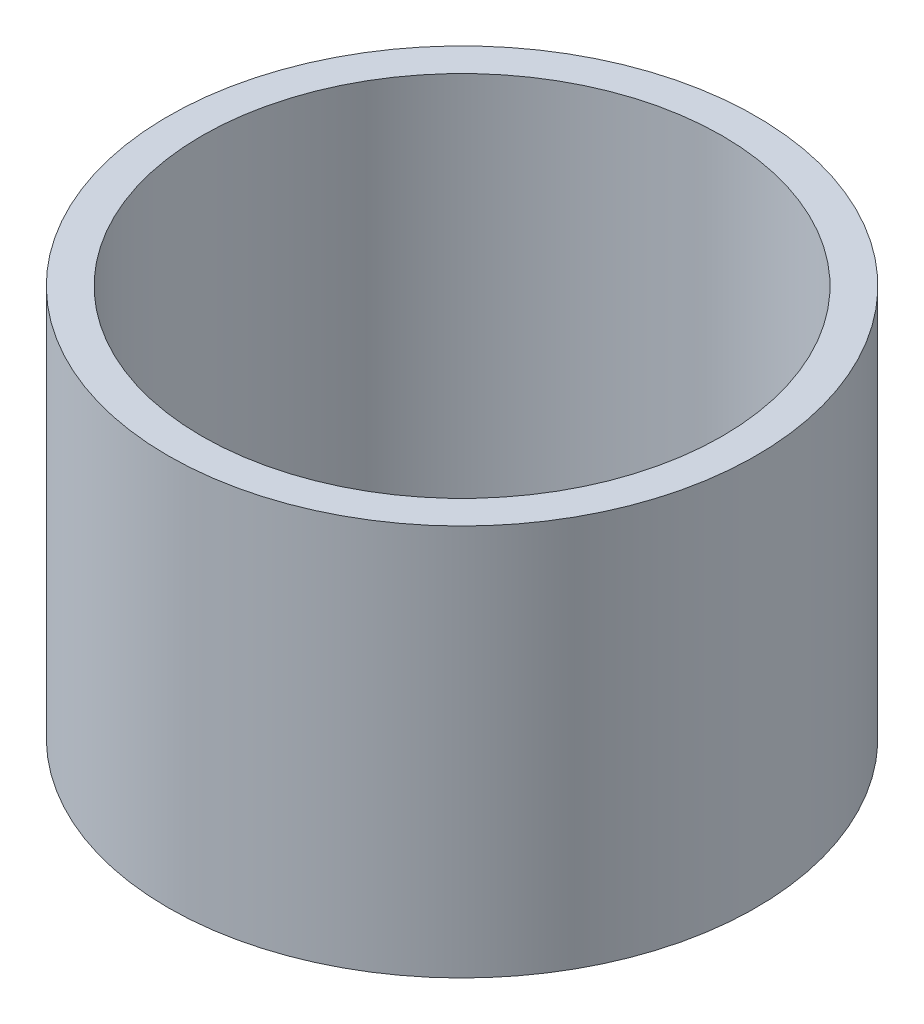
ISO-10303-21;
HEADER;
FILE_DESCRIPTION(('STEP AP214'),'2;1');
FILE_NAME('part.step','',(''),(''),'','','');
FILE_SCHEMA(('AUTOMOTIVE_DESIGN { 1 0 10303 214 1 1 1 1 }'));
ENDSEC;
DATA;
#1=APPLICATION_CONTEXT('core data for automotive mechanical design processes');
#2=APPLICATION_PROTOCOL_DEFINITION('international standard','automotive_design',2000,#1);
#3=PRODUCT_CONTEXT('',#1,'mechanical');
#4=PRODUCT('Part','Part','',(#3));
#5=PRODUCT_RELATED_PRODUCT_CATEGORY('part','',(#4));
#6=PRODUCT_DEFINITION_FORMATION('','',#4);
#7=PRODUCT_DEFINITION_CONTEXT('part definition',#1,'design');
#8=PRODUCT_DEFINITION('design','',#6,#7);
#9=PRODUCT_DEFINITION_SHAPE('','',#8);
#10=(LENGTH_UNIT() NAMED_UNIT(*) SI_UNIT(.MILLI.,.METRE.));
#11=(NAMED_UNIT(*) PLANE_ANGLE_UNIT() SI_UNIT($,.RADIAN.));
#12=(NAMED_UNIT(*) SI_UNIT($,.STERADIAN.) SOLID_ANGLE_UNIT());
#13=UNCERTAINTY_MEASURE_WITH_UNIT(LENGTH_MEASURE(1.E-05),#10,'distance_accuracy_value','');
#14=(GEOMETRIC_REPRESENTATION_CONTEXT(3) GLOBAL_UNCERTAINTY_ASSIGNED_CONTEXT((#13)) GLOBAL_UNIT_ASSIGNED_CONTEXT((#10,
#11,#12)) REPRESENTATION_CONTEXT('',''));
#15=CARTESIAN_POINT('',(0.,0.,0.));
#16=DIRECTION('',(0.,0.,1.));
#17=DIRECTION('',(1.,0.,0.));
#18=AXIS2_PLACEMENT_3D('',#15,#16,#17);
#19=CARTESIAN_POINT('',(0.,76.5517353800861,0.));
#20=DIRECTION('',(0.,-1.,0.));
#21=DIRECTION('',(0.,0.,-1.));
#22=AXIS2_PLACEMENT_3D('',#19,#20,#21);
#23=CYLINDRICAL_SURFACE('',#22,57.5);
#24=CARTESIAN_POINT('',(0.,76.5517353800861,0.));
#25=DIRECTION('',(0.,1.,0.));
#26=DIRECTION('',(0.,0.,1.));
#27=AXIS2_PLACEMENT_3D('',#24,#25,#26);
#28=CIRCLE('',#27,57.5);
#29=CARTESIAN_POINT('',(0.,76.5517353800861,57.5));
#30=VERTEX_POINT('',#29);
#31=EDGE_CURVE('E10',#30,#30,#28,.T.);
#32=ORIENTED_EDGE('',*,*,#31,.F.);
#33=EDGE_LOOP('',(#32));
#34=FACE_BOUND('',#33,.T.);
#35=CARTESIAN_POINT('',(0.,0.,0.));
#36=DIRECTION('',(0.,1.,0.));
#37=DIRECTION('',(0.,0.,1.));
#38=AXIS2_PLACEMENT_3D('',#35,#36,#37);
#39=CIRCLE('',#38,57.5);
#40=CARTESIAN_POINT('',(0.,0.,57.5));
#41=VERTEX_POINT('',#40);
#42=EDGE_CURVE('E37',#41,#41,#39,.T.);
#43=ORIENTED_EDGE('',*,*,#42,.T.);
#44=EDGE_LOOP('',(#43));
#45=FACE_BOUND('',#44,.T.);
#46=ADVANCED_FACE('F40',(#34,#45),#23,.T.);
#47=CARTESIAN_POINT('',(0.,76.5517353800861,0.));
#48=DIRECTION('',(0.,1.,0.));
#49=DIRECTION('',(0.,0.,1.));
#50=AXIS2_PLACEMENT_3D('',#47,#48,#49);
#51=PLANE('',#50);
#52=CARTESIAN_POINT('',(0.,76.5517353800861,0.));
#53=DIRECTION('',(0.,1.,0.));
#54=DIRECTION('',(0.,0.,1.));
#55=AXIS2_PLACEMENT_3D('',#52,#53,#54);
#56=CIRCLE('',#55,50.8880558910588);
#57=CARTESIAN_POINT('',(0.,76.5517353800861,50.8880558910588));
#58=VERTEX_POINT('',#57);
#59=EDGE_CURVE('E50',#58,#58,#56,.T.);
#60=ORIENTED_EDGE('',*,*,#59,.F.);
#61=EDGE_LOOP('',(#60));
#62=FACE_BOUND('',#61,.T.);
#63=ORIENTED_EDGE('',*,*,#31,.T.);
#64=EDGE_LOOP('',(#63));
#65=FACE_BOUND('',#64,.T.);
#66=ADVANCED_FACE('F59',(#62,#65),#51,.T.);
#67=CARTESIAN_POINT('',(0.,0.,0.));
#68=DIRECTION('',(0.,1.,0.));
#69=DIRECTION('',(0.,0.,1.));
#70=AXIS2_PLACEMENT_3D('',#67,#68,#69);
#71=PLANE('',#70);
#72=CARTESIAN_POINT('',(0.,0.,0.));
#73=DIRECTION('',(0.,1.,0.));
#74=DIRECTION('',(0.,0.,1.));
#75=AXIS2_PLACEMENT_3D('',#72,#73,#74);
#76=CIRCLE('',#75,50.8880558910588);
#77=CARTESIAN_POINT('',(0.,0.,50.8880558910588));
#78=VERTEX_POINT('',#77);
#79=EDGE_CURVE('E47',#78,#78,#76,.T.);
#80=ORIENTED_EDGE('',*,*,#79,.T.);
#81=EDGE_LOOP('',(#80));
#82=FACE_BOUND('',#81,.T.);
#83=ORIENTED_EDGE('',*,*,#42,.F.);
#84=EDGE_LOOP('',(#83));
#85=FACE_BOUND('',#84,.T.);
#86=ADVANCED_FACE('F58',(#82,#85),#71,.F.);
#87=CARTESIAN_POINT('',(0.,76.5517353800861,0.));
#88=DIRECTION('',(0.,-1.,0.));
#89=DIRECTION('',(0.,0.,-1.));
#90=AXIS2_PLACEMENT_3D('',#87,#88,#89);
#91=CYLINDRICAL_SURFACE('',#90,50.8880558910588);
#92=ORIENTED_EDGE('',*,*,#59,.T.);
#93=EDGE_LOOP('',(#92));
#94=FACE_BOUND('',#93,.T.);
#95=ORIENTED_EDGE('',*,*,#79,.F.);
#96=EDGE_LOOP('',(#95));
#97=FACE_BOUND('',#96,.T.);
#98=ADVANCED_FACE('F54',(#94,#97),#91,.F.);
#99=CLOSED_SHELL('',(#46,#66,#86,#98));
#100=MANIFOLD_SOLID_BREP('B2',#99);
#101=ADVANCED_BREP_SHAPE_REPRESENTATION('',(#18,#100),#14);
#102=SHAPE_DEFINITION_REPRESENTATION(#9,#101);
ENDSEC;
END-ISO-10303-21;
